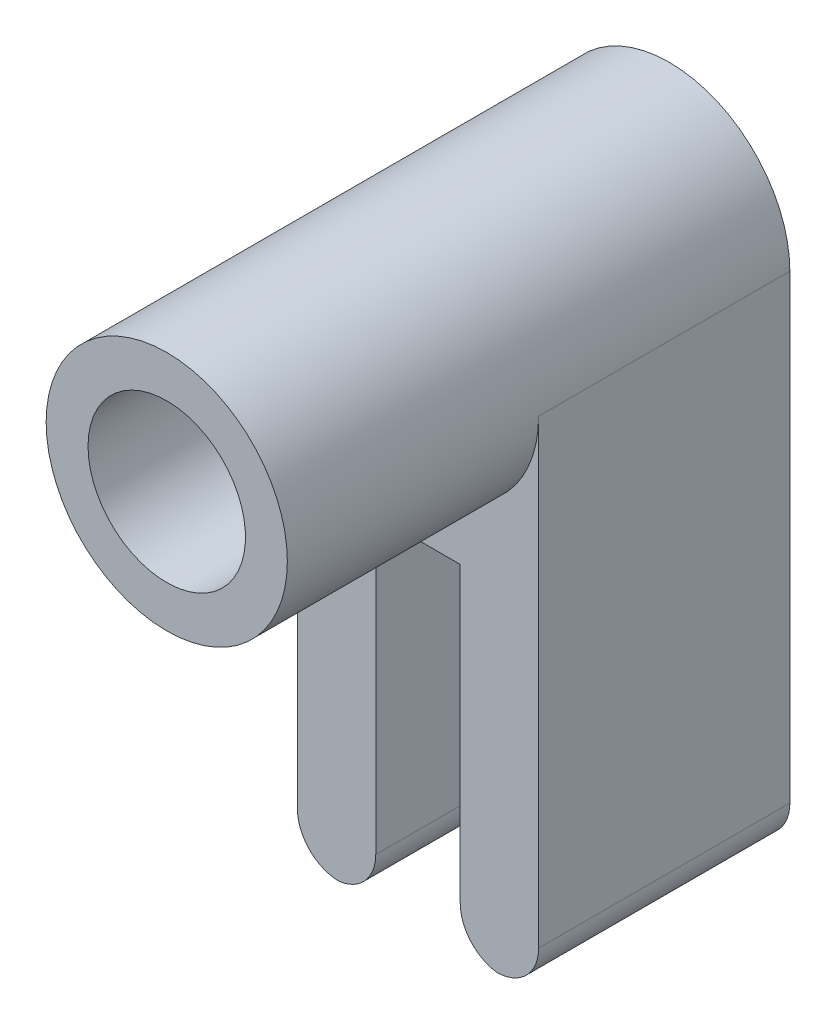
ISO-10303-21;
HEADER;
FILE_DESCRIPTION(('STEP AP214'),'2;1');
FILE_NAME('part.step','',(''),(''),'','','');
FILE_SCHEMA(('AUTOMOTIVE_DESIGN { 1 0 10303 214 1 1 1 1 }'));
ENDSEC;
DATA;
#1=APPLICATION_CONTEXT('core data for automotive mechanical design processes');
#2=APPLICATION_PROTOCOL_DEFINITION('international standard','automotive_design',2000,#1);
#3=PRODUCT_CONTEXT('',#1,'mechanical');
#4=PRODUCT('Part','Part','',(#3));
#5=PRODUCT_RELATED_PRODUCT_CATEGORY('part','',(#4));
#6=PRODUCT_DEFINITION_FORMATION('','',#4);
#7=PRODUCT_DEFINITION_CONTEXT('part definition',#1,'design');
#8=PRODUCT_DEFINITION('design','',#6,#7);
#9=PRODUCT_DEFINITION_SHAPE('','',#8);
#10=(LENGTH_UNIT() NAMED_UNIT(*) SI_UNIT(.MILLI.,.METRE.));
#11=(NAMED_UNIT(*) PLANE_ANGLE_UNIT() SI_UNIT($,.RADIAN.));
#12=(NAMED_UNIT(*) SI_UNIT($,.STERADIAN.) SOLID_ANGLE_UNIT());
#13=UNCERTAINTY_MEASURE_WITH_UNIT(LENGTH_MEASURE(1.E-05),#10,'distance_accuracy_value','');
#14=(GEOMETRIC_REPRESENTATION_CONTEXT(3) GLOBAL_UNCERTAINTY_ASSIGNED_CONTEXT((#13)) GLOBAL_UNIT_ASSIGNED_CONTEXT((#10,
#11,#12)) REPRESENTATION_CONTEXT('',''));
#15=CARTESIAN_POINT('',(0.,0.,0.));
#16=DIRECTION('',(0.,0.,1.));
#17=DIRECTION('',(1.,0.,0.));
#18=AXIS2_PLACEMENT_3D('',#15,#16,#17);
#19=CARTESIAN_POINT('',(0.,0.,7.62));
#20=DIRECTION('',(0.,0.,1.));
#21=DIRECTION('',(1.,0.,0.));
#22=AXIS2_PLACEMENT_3D('',#19,#20,#21);
#23=PLANE('',#22);
#24=CARTESIAN_POINT('',(0.,0.,7.62));
#25=DIRECTION('',(0.,0.,1.));
#26=DIRECTION('',(1.,0.,0.));
#27=AXIS2_PLACEMENT_3D('',#24,#25,#26);
#28=CIRCLE('',#27,3.6576);
#29=CARTESIAN_POINT('',(3.6576,0.,7.62));
#30=VERTEX_POINT('',#29);
#31=EDGE_CURVE('E171',#30,#30,#28,.T.);
#32=ORIENTED_EDGE('',*,*,#31,.T.);
#33=EDGE_LOOP('',(#32));
#34=FACE_BOUND('',#33,.T.);
#35=CARTESIAN_POINT('',(0.,0.,7.62));
#36=DIRECTION('',(0.,0.,1.));
#37=DIRECTION('',(1.,0.,0.));
#38=AXIS2_PLACEMENT_3D('',#35,#36,#37);
#39=CIRCLE('',#38,2.3876);
#40=CARTESIAN_POINT('',(-2.3876,0.,7.62));
#41=VERTEX_POINT('',#40);
#42=EDGE_CURVE('E165',#41,#41,#39,.T.);
#43=ORIENTED_EDGE('',*,*,#42,.F.);
#44=EDGE_LOOP('',(#43));
#45=FACE_BOUND('',#44,.T.);
#46=ADVANCED_FACE('F37',(#34,#45),#23,.T.);
#47=CARTESIAN_POINT('',(0.,0.,7.62));
#48=DIRECTION('',(0.,0.,-1.));
#49=DIRECTION('',(-1.,0.,0.));
#50=AXIS2_PLACEMENT_3D('',#47,#48,#49);
#51=CYLINDRICAL_SURFACE('',#50,3.6576);
#52=ORIENTED_EDGE('',*,*,#31,.F.);
#53=EDGE_LOOP('',(#52));
#54=FACE_BOUND('',#53,.T.);
#55=CARTESIAN_POINT('',(0.,0.,0.));
#56=DIRECTION('',(0.,0.,1.));
#57=DIRECTION('',(1.,0.,0.));
#58=AXIS2_PLACEMENT_3D('',#55,#56,#57);
#59=CIRCLE('',#58,3.6576);
#60=CARTESIAN_POINT('',(-3.6576,0.,0.));
#61=VERTEX_POINT('',#60);
#62=CARTESIAN_POINT('',(3.6576,0.,0.));
#63=VERTEX_POINT('',#62);
#64=EDGE_CURVE('E168',#61,#63,#59,.T.);
#65=ORIENTED_EDGE('',*,*,#64,.T.);
#66=DIRECTION('',(0.,0.,1.));
#67=VECTOR('',#66,1.);
#68=CARTESIAN_POINT('',(3.6576,0.,-7.62));
#69=LINE('',#68,#67);
#70=CARTESIAN_POINT('',(3.6576,0.,-7.62));
#71=VERTEX_POINT('',#70);
#72=EDGE_CURVE('E162',#71,#63,#69,.T.);
#73=ORIENTED_EDGE('',*,*,#72,.F.);
#74=CARTESIAN_POINT('',(0.,0.,-7.62));
#75=DIRECTION('',(0.,0.,-1.));
#76=DIRECTION('',(-1.,0.,0.));
#77=AXIS2_PLACEMENT_3D('',#74,#75,#76);
#78=CIRCLE('',#77,3.6576);
#79=CARTESIAN_POINT('',(-3.6576,0.,-7.62));
#80=VERTEX_POINT('',#79);
#81=EDGE_CURVE('E147',#80,#71,#78,.T.);
#82=ORIENTED_EDGE('',*,*,#81,.F.);
#83=DIRECTION('',(0.,0.,1.));
#84=VECTOR('',#83,1.);
#85=CARTESIAN_POINT('',(-3.6576,0.,-7.62));
#86=LINE('',#85,#84);
#87=EDGE_CURVE('E156',#80,#61,#86,.T.);
#88=ORIENTED_EDGE('',*,*,#87,.T.);
#89=EDGE_LOOP('',(#65,#73,#82,#88));
#90=FACE_BOUND('',#89,.T.);
#91=ADVANCED_FACE('F222',(#54,#90),#51,.T.);
#92=CARTESIAN_POINT('',(0.,0.,7.62));
#93=DIRECTION('',(0.,0.,-1.));
#94=DIRECTION('',(-1.,0.,0.));
#95=AXIS2_PLACEMENT_3D('',#92,#93,#94);
#96=CYLINDRICAL_SURFACE('',#95,2.3876);
#97=CARTESIAN_POINT('',(0.,0.,0.));
#98=DIRECTION('',(0.,0.,1.));
#99=DIRECTION('',(1.,0.,0.));
#100=AXIS2_PLACEMENT_3D('',#97,#98,#99);
#101=CIRCLE('',#100,2.3876);
#102=CARTESIAN_POINT('',(-2.3876,0.,0.));
#103=VERTEX_POINT('',#102);
#104=EDGE_CURVE('E164',#103,#103,#101,.T.);
#105=CARTESIAN_POINT('',(-2.3876,0.,7.62));
#106=CARTESIAN_POINT('',(-2.3876,0.,7.540625));
#107=CARTESIAN_POINT('',(-2.3876,0.,7.46125));
#108=CARTESIAN_POINT('',(-2.3876,0.,7.3025));
#109=CARTESIAN_POINT('',(-2.3876,0.,7.223125));
#110=CARTESIAN_POINT('',(-2.3876,0.,7.064375));
#111=CARTESIAN_POINT('',(-2.3876,0.,6.985));
#112=CARTESIAN_POINT('',(-2.3876,0.,6.82625));
#113=CARTESIAN_POINT('',(-2.3876,0.,6.746875));
#114=CARTESIAN_POINT('',(-2.3876,0.,6.588125));
#115=CARTESIAN_POINT('',(-2.3876,0.,6.50875));
#116=CARTESIAN_POINT('',(-2.3876,0.,6.35));
#117=CARTESIAN_POINT('',(-2.3876,0.,6.270625));
#118=CARTESIAN_POINT('',(-2.3876,0.,6.111875));
#119=CARTESIAN_POINT('',(-2.3876,0.,6.0325));
#120=CARTESIAN_POINT('',(-2.3876,0.,5.87375));
#121=CARTESIAN_POINT('',(-2.3876,0.,5.794375));
#122=CARTESIAN_POINT('',(-2.3876,0.,5.635625));
#123=CARTESIAN_POINT('',(-2.3876,0.,5.55625));
#124=CARTESIAN_POINT('',(-2.3876,0.,5.3975));
#125=CARTESIAN_POINT('',(-2.3876,0.,5.318125));
#126=CARTESIAN_POINT('',(-2.3876,0.,5.159375));
#127=CARTESIAN_POINT('',(-2.3876,0.,5.08));
#128=CARTESIAN_POINT('',(-2.3876,0.,4.92125));
#129=CARTESIAN_POINT('',(-2.3876,0.,4.841875));
#130=CARTESIAN_POINT('',(-2.3876,0.,4.683125));
#131=CARTESIAN_POINT('',(-2.3876,0.,4.60375));
#132=CARTESIAN_POINT('',(-2.3876,0.,4.445));
#133=CARTESIAN_POINT('',(-2.3876,0.,4.365625));
#134=CARTESIAN_POINT('',(-2.3876,0.,4.206875));
#135=CARTESIAN_POINT('',(-2.3876,0.,4.1275));
#136=CARTESIAN_POINT('',(-2.3876,0.,3.96875));
#137=CARTESIAN_POINT('',(-2.3876,0.,3.889375));
#138=CARTESIAN_POINT('',(-2.3876,0.,3.730625));
#139=CARTESIAN_POINT('',(-2.3876,0.,3.65125));
#140=CARTESIAN_POINT('',(-2.3876,0.,3.4925));
#141=CARTESIAN_POINT('',(-2.3876,0.,3.413125));
#142=CARTESIAN_POINT('',(-2.3876,0.,3.254375));
#143=CARTESIAN_POINT('',(-2.3876,0.,3.175));
#144=CARTESIAN_POINT('',(-2.3876,0.,3.01625));
#145=CARTESIAN_POINT('',(-2.3876,0.,2.936875));
#146=CARTESIAN_POINT('',(-2.3876,0.,2.778125));
#147=CARTESIAN_POINT('',(-2.3876,0.,2.69875));
#148=CARTESIAN_POINT('',(-2.3876,0.,2.54));
#149=CARTESIAN_POINT('',(-2.3876,0.,2.460625));
#150=CARTESIAN_POINT('',(-2.3876,0.,2.301875));
#151=CARTESIAN_POINT('',(-2.3876,0.,2.2225));
#152=CARTESIAN_POINT('',(-2.3876,0.,2.06375));
#153=CARTESIAN_POINT('',(-2.3876,0.,1.984375));
#154=CARTESIAN_POINT('',(-2.3876,0.,1.825625));
#155=CARTESIAN_POINT('',(-2.3876,0.,1.74625));
#156=CARTESIAN_POINT('',(-2.3876,0.,1.5875));
#157=CARTESIAN_POINT('',(-2.3876,0.,1.508125));
#158=CARTESIAN_POINT('',(-2.3876,0.,1.349375));
#159=CARTESIAN_POINT('',(-2.3876,0.,1.27));
#160=CARTESIAN_POINT('',(-2.3876,0.,1.11125));
#161=CARTESIAN_POINT('',(-2.3876,0.,1.031875));
#162=CARTESIAN_POINT('',(-2.3876,0.,0.873125));
#163=CARTESIAN_POINT('',(-2.3876,0.,0.79375));
#164=CARTESIAN_POINT('',(-2.3876,0.,0.635));
#165=CARTESIAN_POINT('',(-2.3876,0.,0.555625));
#166=CARTESIAN_POINT('',(-2.3876,0.,0.396875));
#167=CARTESIAN_POINT('',(-2.3876,0.,0.3175));
#168=CARTESIAN_POINT('',(-2.3876,0.,0.15875));
#169=CARTESIAN_POINT('',(-2.3876,0.,0.0793749999999999));
#170=CARTESIAN_POINT('',(-2.3876,0.,0.));
#171=B_SPLINE_CURVE_WITH_KNOTS('',3,(#105,#106,#107,#108,#109,#110,#111,#112,#113,#114,#115,
#116,#117,#118,#119,#120,#121,#122,#123,#124,#125,#126,#127,#128,#129,#130,#131,#132,#133,#134,
#135,#136,#137,#138,#139,#140,#141,#142,#143,#144,#145,#146,#147,#148,#149,#150,#151,#152,#153,
#154,#155,#156,#157,#158,#159,#160,#161,#162,#163,#164,#165,#166,#167,#168,#169,#170),
.UNSPECIFIED.,.F.,.F.,(4,2,2,2,2,2,2,2,2,2,2,2,2,2,2,2,2,2,2,2,2,2,2,2,2,2,2,2,2,2,2,2,4),(0.,
0.238125,0.47625,0.714375000000001,0.9525,1.190625,1.42875,1.666875,1.905,2.143125,2.38125,
2.619375,2.8575,3.095625,3.33375,3.571875,3.81,4.048125,4.28625,4.524375,4.7625,5.000625,
5.23875,5.476875,5.715,5.953125,6.19125,6.429375,6.6675,6.905625,7.14375,7.381875,7.62),.UNSPECIFIED.);
#172=EDGE_CURVE('BSEAM246',#41,#103,#171,.T.);
#173=ORIENTED_EDGE('',*,*,#42,.T.);
#174=ORIENTED_EDGE('',*,*,#104,.F.);
#175=ORIENTED_EDGE('',*,*,#172,.T.);
#176=ORIENTED_EDGE('',*,*,#172,.F.);
#177=EDGE_LOOP('',(#173,#175,#174,#176));
#178=FACE_BOUND('',#177,.T.);
#179=ADVANCED_FACE('F246',(#178),#96,.F.);
#180=CARTESIAN_POINT('',(0.,0.,0.));
#181=DIRECTION('',(0.,0.,-1.));
#182=DIRECTION('',(-1.,0.,0.));
#183=AXIS2_PLACEMENT_3D('',#180,#181,#182);
#184=PLANE('',#183);
#185=CARTESIAN_POINT('',(0.,0.,0.));
#186=DIRECTION('',(0.,0.,1.));
#187=DIRECTION('',(1.,0.,0.));
#188=AXIS2_PLACEMENT_3D('',#185,#186,#187);
#189=CIRCLE('',#188,1.8);
#190=CARTESIAN_POINT('',(1.8,0.,0.));
#191=VERTEX_POINT('',#190);
#192=EDGE_CURVE('E285',#191,#191,#189,.T.);
#193=ORIENTED_EDGE('',*,*,#192,.F.);
#194=EDGE_LOOP('',(#193));
#195=FACE_BOUND('',#194,.T.);
#196=ORIENTED_EDGE('',*,*,#104,.T.);
#197=EDGE_LOOP('',(#196));
#198=FACE_BOUND('',#197,.T.);
#199=ADVANCED_FACE('F271',(#195,#198),#184,.F.);
#200=CARTESIAN_POINT('',(3.6576,0.,-7.62));
#201=DIRECTION('',(-1.,0.,0.));
#202=DIRECTION('',(0.,-1.,0.));
#203=AXIS2_PLACEMENT_3D('',#200,#201,#202);
#204=PLANE('',#203);
#205=DIRECTION('',(0.,-1.,0.));
#206=VECTOR('',#205,1.);
#207=CARTESIAN_POINT('',(3.6576,0.,0.));
#208=LINE('',#207,#206);
#209=CARTESIAN_POINT('',(3.6576,-13.97,0.));
#210=VERTEX_POINT('',#209);
#211=EDGE_CURVE('E142',#63,#210,#208,.T.);
#212=ORIENTED_EDGE('',*,*,#211,.T.);
#213=DIRECTION('',(0.,0.,1.));
#214=VECTOR('',#213,1.);
#215=CARTESIAN_POINT('',(3.6576,-13.97,-7.62));
#216=LINE('',#215,#214);
#217=CARTESIAN_POINT('',(3.6576,-13.97,-7.62));
#218=VERTEX_POINT('',#217);
#219=EDGE_CURVE('E192',#210,#218,#216,.F.);
#220=ORIENTED_EDGE('',*,*,#219,.T.);
#221=DIRECTION('',(0.,-1.,0.));
#222=VECTOR('',#221,1.);
#223=CARTESIAN_POINT('',(3.6576,0.,-7.62));
#224=LINE('',#223,#222);
#225=EDGE_CURVE('E150',#71,#218,#224,.T.);
#226=ORIENTED_EDGE('',*,*,#225,.F.);
#227=ORIENTED_EDGE('',*,*,#72,.T.);
#228=EDGE_LOOP('',(#212,#220,#226,#227));
#229=FACE_BOUND('',#228,.T.);
#230=ADVANCED_FACE('F216',(#229),#204,.F.);
#231=CARTESIAN_POINT('',(-3.6576,-15.24,-7.62));
#232=DIRECTION('',(1.,0.,0.));
#233=DIRECTION('',(0.,1.,0.));
#234=AXIS2_PLACEMENT_3D('',#231,#232,#233);
#235=PLANE('',#234);
#236=DIRECTION('',(0.,1.,0.));
#237=VECTOR('',#236,1.);
#238=CARTESIAN_POINT('',(-3.6576,-15.24,-7.62));
#239=LINE('',#238,#237);
#240=CARTESIAN_POINT('',(-3.6576,-13.97,-7.62));
#241=VERTEX_POINT('',#240);
#242=EDGE_CURVE('E154',#241,#80,#239,.T.);
#243=ORIENTED_EDGE('',*,*,#242,.F.);
#244=DIRECTION('',(0.,0.,1.));
#245=VECTOR('',#244,1.);
#246=CARTESIAN_POINT('',(-3.6576,-13.97,-7.62));
#247=LINE('',#246,#245);
#248=CARTESIAN_POINT('',(-3.6576,-13.97,0.));
#249=VERTEX_POINT('',#248);
#250=EDGE_CURVE('E174',#241,#249,#247,.T.);
#251=ORIENTED_EDGE('',*,*,#250,.T.);
#252=DIRECTION('',(0.,1.,0.));
#253=VECTOR('',#252,1.);
#254=CARTESIAN_POINT('',(-3.6576,-15.24,0.));
#255=LINE('',#254,#253);
#256=EDGE_CURVE('E151',#249,#61,#255,.T.);
#257=ORIENTED_EDGE('',*,*,#256,.T.);
#258=ORIENTED_EDGE('',*,*,#87,.F.);
#259=EDGE_LOOP('',(#243,#251,#257,#258));
#260=FACE_BOUND('',#259,.T.);
#261=ADVANCED_FACE('F226',(#260),#235,.F.);
#262=CARTESIAN_POINT('',(0.,0.,-7.62));
#263=DIRECTION('',(0.,0.,-1.));
#264=DIRECTION('',(-1.,0.,0.));
#265=AXIS2_PLACEMENT_3D('',#262,#263,#264);
#266=PLANE('',#265);
#267=CARTESIAN_POINT('',(0.,0.,-7.62));
#268=DIRECTION('',(0.,0.,1.));
#269=DIRECTION('',(1.,0.,0.));
#270=AXIS2_PLACEMENT_3D('',#267,#268,#269);
#271=CIRCLE('',#270,1.8);
#272=CARTESIAN_POINT('',(1.8,0.,-7.62));
#273=VERTEX_POINT('',#272);
#274=EDGE_CURVE('E130',#273,#273,#271,.T.);
#275=ORIENTED_EDGE('',*,*,#274,.T.);
#276=EDGE_LOOP('',(#275));
#277=FACE_BOUND('',#276,.T.);
#278=CARTESIAN_POINT('',(2.3876,-13.97,-7.62));
#279=DIRECTION('',(0.,0.,-1.));
#280=DIRECTION('',(-1.,0.,0.));
#281=AXIS2_PLACEMENT_3D('',#278,#279,#280);
#282=CIRCLE('',#281,1.27);
#283=CARTESIAN_POINT('',(2.3876,-15.24,-7.62));
#284=VERTEX_POINT('',#283);
#285=EDGE_CURVE('E188',#218,#284,#282,.T.);
#286=ORIENTED_EDGE('',*,*,#285,.T.);
#287=CARTESIAN_POINT('',(2.5511,-13.9805684814171,-7.62));
#288=DIRECTION('',(0.,0.,-1.));
#289=DIRECTION('',(-1.,0.,0.));
#290=AXIS2_PLACEMENT_3D('',#287,#288,#289);
#291=CIRCLE('',#290,1.27);
#292=CARTESIAN_POINT('',(1.2811,-13.9805684814171,-7.62));
#293=VERTEX_POINT('',#292);
#294=EDGE_CURVE('E45',#284,#293,#291,.T.);
#295=ORIENTED_EDGE('',*,*,#294,.T.);
#296=DIRECTION('',(0.,-1.,0.));
#297=VECTOR('',#296,1.);
#298=CARTESIAN_POINT('',(1.2811,-5.08,-7.62));
#299=LINE('',#298,#297);
#300=CARTESIAN_POINT('',(1.2811,-5.08,-7.62));
#301=VERTEX_POINT('',#300);
#302=EDGE_CURVE('E121',#301,#293,#299,.T.);
#303=ORIENTED_EDGE('',*,*,#302,.F.);
#304=DIRECTION('',(1.,0.,0.));
#305=VECTOR('',#304,1.);
#306=CARTESIAN_POINT('',(-1.2811,-5.08,-7.62));
#307=LINE('',#306,#305);
#308=CARTESIAN_POINT('',(-1.2811,-5.08,-7.62));
#309=VERTEX_POINT('',#308);
#310=EDGE_CURVE('E127',#309,#301,#307,.T.);
#311=ORIENTED_EDGE('',*,*,#310,.F.);
#312=DIRECTION('',(0.,-1.,0.));
#313=VECTOR('',#312,1.);
#314=CARTESIAN_POINT('',(-1.2811,-5.08,-7.62));
#315=LINE('',#314,#313);
#316=CARTESIAN_POINT('',(-1.2811,-13.9805684814171,-7.62));
#317=VERTEX_POINT('',#316);
#318=EDGE_CURVE('E114',#309,#317,#315,.T.);
#319=ORIENTED_EDGE('',*,*,#318,.T.);
#320=CARTESIAN_POINT('',(-2.5511,-13.9805684814171,-7.62));
#321=DIRECTION('',(0.,0.,-1.));
#322=DIRECTION('',(-1.,0.,0.));
#323=AXIS2_PLACEMENT_3D('',#320,#321,#322);
#324=CIRCLE('',#323,1.27);
#325=CARTESIAN_POINT('',(-2.3876,-15.24,-7.62));
#326=VERTEX_POINT('',#325);
#327=EDGE_CURVE('E52',#317,#326,#324,.T.);
#328=ORIENTED_EDGE('',*,*,#327,.T.);
#329=CARTESIAN_POINT('',(-2.3876,-13.97,-7.62));
#330=DIRECTION('',(0.,0.,-1.));
#331=DIRECTION('',(-1.,0.,0.));
#332=AXIS2_PLACEMENT_3D('',#329,#330,#331);
#333=CIRCLE('',#332,1.27);
#334=EDGE_CURVE('E190',#326,#241,#333,.T.);
#335=ORIENTED_EDGE('',*,*,#334,.T.);
#336=ORIENTED_EDGE('',*,*,#242,.T.);
#337=ORIENTED_EDGE('',*,*,#81,.T.);
#338=ORIENTED_EDGE('',*,*,#225,.T.);
#339=EDGE_LOOP('',(#286,#295,#303,#311,#319,#328,#335,#336,#337,#338));
#340=FACE_BOUND('',#339,.T.);
#341=ADVANCED_FACE('F132',(#277,#340),#266,.T.);
#342=DIRECTION('',(0.,-1.,0.));
#343=VECTOR('',#342,1.);
#344=CARTESIAN_POINT('',(1.2811,-5.08,0.));
#345=LINE('',#344,#343);
#346=CARTESIAN_POINT('',(1.2811,-5.08,0.));
#347=VERTEX_POINT('',#346);
#348=CARTESIAN_POINT('',(1.2811,-13.9805684814171,0.));
#349=VERTEX_POINT('',#348);
#350=EDGE_CURVE('E143',#347,#349,#345,.T.);
#351=ORIENTED_EDGE('',*,*,#350,.T.);
#352=CARTESIAN_POINT('',(2.5511,-13.9805684814171,0.));
#353=DIRECTION('',(0.,0.,-1.));
#354=DIRECTION('',(-1.,0.,0.));
#355=AXIS2_PLACEMENT_3D('',#352,#353,#354);
#356=CIRCLE('',#355,1.27);
#357=CARTESIAN_POINT('',(2.3876,-15.24,0.));
#358=VERTEX_POINT('',#357);
#359=EDGE_CURVE('E198',#349,#358,#356,.F.);
#360=ORIENTED_EDGE('',*,*,#359,.T.);
#361=CARTESIAN_POINT('',(2.3876,-13.97,0.));
#362=DIRECTION('',(0.,0.,-1.));
#363=DIRECTION('',(-1.,0.,0.));
#364=AXIS2_PLACEMENT_3D('',#361,#362,#363);
#365=CIRCLE('',#364,1.27);
#366=EDGE_CURVE('E179',#358,#210,#365,.F.);
#367=ORIENTED_EDGE('',*,*,#366,.T.);
#368=ORIENTED_EDGE('',*,*,#211,.F.);
#369=ORIENTED_EDGE('',*,*,#64,.F.);
#370=ORIENTED_EDGE('',*,*,#256,.F.);
#371=CARTESIAN_POINT('',(-2.3876,-13.97,0.));
#372=DIRECTION('',(0.,0.,-1.));
#373=DIRECTION('',(-1.,0.,0.));
#374=AXIS2_PLACEMENT_3D('',#371,#372,#373);
#375=CIRCLE('',#374,1.27);
#376=CARTESIAN_POINT('',(-2.3876,-15.24,0.));
#377=VERTEX_POINT('',#376);
#378=EDGE_CURVE('E181',#249,#377,#375,.F.);
#379=ORIENTED_EDGE('',*,*,#378,.T.);
#380=CARTESIAN_POINT('',(-2.5511,-13.9805684814171,0.));
#381=DIRECTION('',(0.,0.,-1.));
#382=DIRECTION('',(-1.,0.,0.));
#383=AXIS2_PLACEMENT_3D('',#380,#381,#382);
#384=CIRCLE('',#383,1.27);
#385=CARTESIAN_POINT('',(-1.2811,-13.9805684814171,0.));
#386=VERTEX_POINT('',#385);
#387=EDGE_CURVE('E59',#377,#386,#384,.F.);
#388=ORIENTED_EDGE('',*,*,#387,.T.);
#389=DIRECTION('',(0.,-1.,0.));
#390=VECTOR('',#389,1.);
#391=CARTESIAN_POINT('',(-1.2811,-5.08,0.));
#392=LINE('',#391,#390);
#393=CARTESIAN_POINT('',(-1.2811,-5.08,0.));
#394=VERTEX_POINT('',#393);
#395=EDGE_CURVE('E140',#394,#386,#392,.T.);
#396=ORIENTED_EDGE('',*,*,#395,.F.);
#397=DIRECTION('',(-1.,0.,0.));
#398=VECTOR('',#397,1.);
#399=CARTESIAN_POINT('',(-1.2811,-5.08,0.));
#400=LINE('',#399,#398);
#401=EDGE_CURVE('E122',#347,#394,#400,.T.);
#402=ORIENTED_EDGE('',*,*,#401,.F.);
#403=EDGE_LOOP('',(#351,#360,#367,#368,#369,#370,#379,#388,#396,#402));
#404=FACE_BOUND('',#403,.T.);
#405=ADVANCED_FACE('F210',(#404),#184,.F.);
#406=CARTESIAN_POINT('',(-2.3876,-13.97,-7.62));
#407=DIRECTION('',(0.,0.,1.));
#408=DIRECTION('',(1.,0.,0.));
#409=AXIS2_PLACEMENT_3D('',#406,#407,#408);
#410=CYLINDRICAL_SURFACE('',#409,1.27);
#411=ORIENTED_EDGE('',*,*,#334,.F.);
#412=DIRECTION('',(0.,0.,1.));
#413=VECTOR('',#412,1.);
#414=CARTESIAN_POINT('',(-2.3876,-15.24,-7.62));
#415=LINE('',#414,#413);
#416=EDGE_CURVE('E186',#377,#326,#415,.F.);
#417=ORIENTED_EDGE('',*,*,#416,.F.);
#418=ORIENTED_EDGE('',*,*,#378,.F.);
#419=ORIENTED_EDGE('',*,*,#250,.F.);
#420=EDGE_LOOP('',(#411,#417,#418,#419));
#421=FACE_BOUND('',#420,.T.);
#422=ADVANCED_FACE('F230',(#421),#410,.T.);
#423=CARTESIAN_POINT('',(2.3876,-13.97,-7.62));
#424=DIRECTION('',(0.,0.,1.));
#425=DIRECTION('',(1.,0.,0.));
#426=AXIS2_PLACEMENT_3D('',#423,#424,#425);
#427=CYLINDRICAL_SURFACE('',#426,1.27);
#428=ORIENTED_EDGE('',*,*,#285,.F.);
#429=ORIENTED_EDGE('',*,*,#219,.F.);
#430=ORIENTED_EDGE('',*,*,#366,.F.);
#431=DIRECTION('',(0.,0.,1.));
#432=VECTOR('',#431,1.);
#433=CARTESIAN_POINT('',(2.3876,-15.24,-7.62));
#434=LINE('',#433,#432);
#435=EDGE_CURVE('E183',#284,#358,#434,.T.);
#436=ORIENTED_EDGE('',*,*,#435,.F.);
#437=EDGE_LOOP('',(#428,#429,#430,#436));
#438=FACE_BOUND('',#437,.T.);
#439=ADVANCED_FACE('F214',(#438),#427,.T.);
#440=CARTESIAN_POINT('',(-1.2811,-5.08,0.));
#441=DIRECTION('',(-1.,0.,0.));
#442=DIRECTION('',(0.,0.,1.));
#443=AXIS2_PLACEMENT_3D('',#440,#441,#442);
#444=PLANE('',#443);
#445=ORIENTED_EDGE('',*,*,#395,.T.);
#446=DIRECTION('',(0.,0.,1.));
#447=VECTOR('',#446,1.);
#448=CARTESIAN_POINT('',(-1.2811,-13.9805684814171,0.));
#449=LINE('',#448,#447);
#450=EDGE_CURVE('E11',#386,#317,#449,.F.);
#451=ORIENTED_EDGE('',*,*,#450,.T.);
#452=ORIENTED_EDGE('',*,*,#318,.F.);
#453=DIRECTION('',(0.,0.,-1.));
#454=VECTOR('',#453,1.);
#455=CARTESIAN_POINT('',(-1.2811,-5.08,0.));
#456=LINE('',#455,#454);
#457=EDGE_CURVE('E117',#394,#309,#456,.T.);
#458=ORIENTED_EDGE('',*,*,#457,.F.);
#459=EDGE_LOOP('',(#445,#451,#452,#458));
#460=FACE_BOUND('',#459,.T.);
#461=ADVANCED_FACE('F116',(#460),#444,.F.);
#462=CARTESIAN_POINT('',(1.2811,-5.08,0.));
#463=DIRECTION('',(1.,0.,0.));
#464=DIRECTION('',(0.,0.,-1.));
#465=AXIS2_PLACEMENT_3D('',#462,#463,#464);
#466=PLANE('',#465);
#467=ORIENTED_EDGE('',*,*,#302,.T.);
#468=DIRECTION('',(0.,0.,1.));
#469=VECTOR('',#468,1.);
#470=CARTESIAN_POINT('',(1.2811,-13.9805684814171,0.));
#471=LINE('',#470,#469);
#472=EDGE_CURVE('E194',#293,#349,#471,.T.);
#473=ORIENTED_EDGE('',*,*,#472,.T.);
#474=ORIENTED_EDGE('',*,*,#350,.F.);
#475=DIRECTION('',(0.,0.,1.));
#476=VECTOR('',#475,1.);
#477=CARTESIAN_POINT('',(1.2811,-5.08,0.));
#478=LINE('',#477,#476);
#479=EDGE_CURVE('E134',#301,#347,#478,.T.);
#480=ORIENTED_EDGE('',*,*,#479,.F.);
#481=EDGE_LOOP('',(#467,#473,#474,#480));
#482=FACE_BOUND('',#481,.T.);
#483=ADVANCED_FACE('F206',(#482),#466,.F.);
#484=CARTESIAN_POINT('',(0.,-5.08,0.));
#485=DIRECTION('',(0.,-1.,0.));
#486=DIRECTION('',(0.,0.,-1.));
#487=AXIS2_PLACEMENT_3D('',#484,#485,#486);
#488=PLANE('',#487);
#489=ORIENTED_EDGE('',*,*,#457,.T.);
#490=ORIENTED_EDGE('',*,*,#310,.T.);
#491=ORIENTED_EDGE('',*,*,#479,.T.);
#492=ORIENTED_EDGE('',*,*,#401,.T.);
#493=EDGE_LOOP('',(#489,#490,#491,#492));
#494=FACE_BOUND('',#493,.T.);
#495=ADVANCED_FACE('F126',(#494),#488,.T.);
#496=CARTESIAN_POINT('',(2.5511,-13.9805684814171,-7.62));
#497=DIRECTION('',(0.,0.,1.));
#498=DIRECTION('',(1.,0.,0.));
#499=AXIS2_PLACEMENT_3D('',#496,#497,#498);
#500=CYLINDRICAL_SURFACE('',#499,1.27);
#501=ORIENTED_EDGE('',*,*,#294,.F.);
#502=ORIENTED_EDGE('',*,*,#435,.T.);
#503=ORIENTED_EDGE('',*,*,#359,.F.);
#504=ORIENTED_EDGE('',*,*,#472,.F.);
#505=EDGE_LOOP('',(#501,#502,#503,#504));
#506=FACE_BOUND('',#505,.T.);
#507=ADVANCED_FACE('F208',(#506),#500,.T.);
#508=CARTESIAN_POINT('',(-2.5511,-13.9805684814171,-7.62));
#509=DIRECTION('',(0.,0.,1.));
#510=DIRECTION('',(1.,0.,0.));
#511=AXIS2_PLACEMENT_3D('',#508,#509,#510);
#512=CYLINDRICAL_SURFACE('',#511,1.27);
#513=ORIENTED_EDGE('',*,*,#387,.F.);
#514=ORIENTED_EDGE('',*,*,#416,.T.);
#515=ORIENTED_EDGE('',*,*,#327,.F.);
#516=ORIENTED_EDGE('',*,*,#450,.F.);
#517=EDGE_LOOP('',(#513,#514,#515,#516));
#518=FACE_BOUND('',#517,.T.);
#519=ADVANCED_FACE('F39',(#518),#512,.T.);
#520=CARTESIAN_POINT('',(0.,0.,0.));
#521=DIRECTION('',(0.,0.,1.));
#522=DIRECTION('',(1.,0.,0.));
#523=AXIS2_PLACEMENT_3D('',#520,#521,#522);
#524=CYLINDRICAL_SURFACE('',#523,1.8);
#525=ORIENTED_EDGE('',*,*,#274,.F.);
#526=EDGE_LOOP('',(#525));
#527=FACE_BOUND('',#526,.T.);
#528=ORIENTED_EDGE('',*,*,#192,.T.);
#529=EDGE_LOOP('',(#528));
#530=FACE_BOUND('',#529,.T.);
#531=ADVANCED_FACE('F233',(#527,#530),#524,.F.);
#532=CLOSED_SHELL('',(#46,#91,#179,#199,#230,#261,#341,#405,#422,#439,#461,#483,#495,#507,#519,#531));
#533=MANIFOLD_SOLID_BREP('B2',#532);
#534=ADVANCED_BREP_SHAPE_REPRESENTATION('',(#18,#533),#14);
#535=SHAPE_DEFINITION_REPRESENTATION(#9,#534);
ENDSEC;
END-ISO-10303-21;
